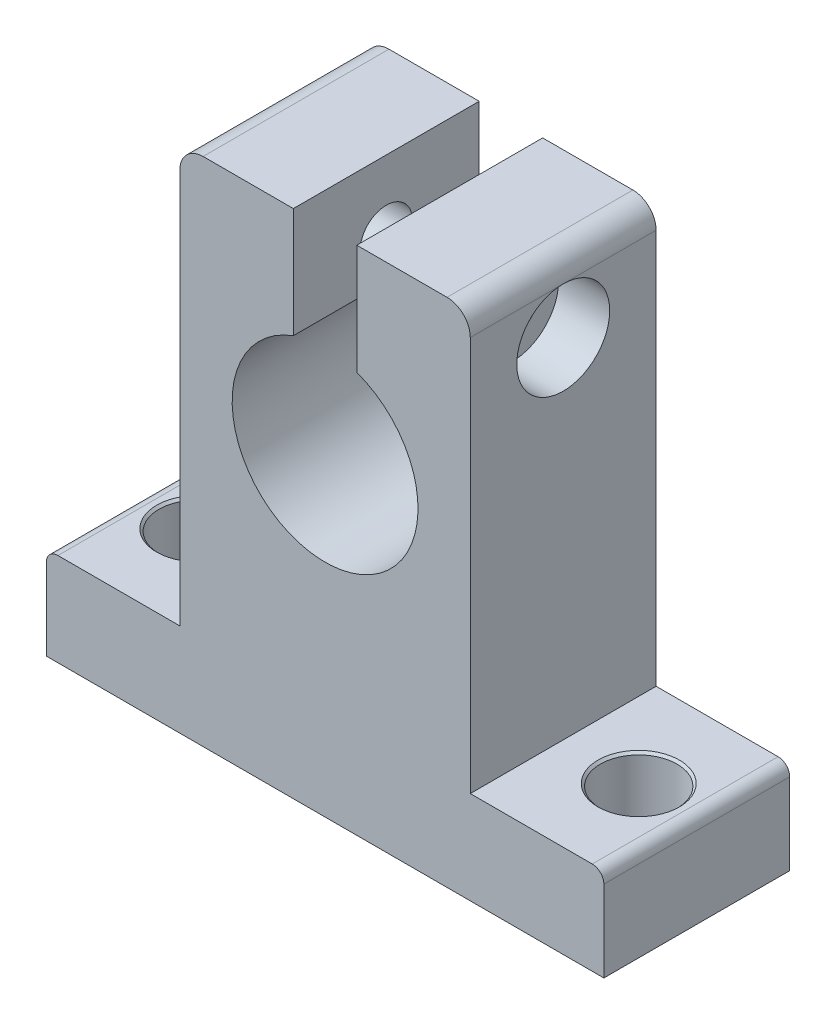
ISO-10303-21;
HEADER;
FILE_DESCRIPTION(('STEP AP214'),'2;1');
FILE_NAME('part.step','',(''),(''),'','','');
FILE_SCHEMA(('AUTOMOTIVE_DESIGN { 1 0 10303 214 1 1 1 1 }'));
ENDSEC;
DATA;
#1=APPLICATION_CONTEXT('core data for automotive mechanical design processes');
#2=APPLICATION_PROTOCOL_DEFINITION('international standard','automotive_design',2000,#1);
#3=PRODUCT_CONTEXT('',#1,'mechanical');
#4=PRODUCT('Part','Part','',(#3));
#5=PRODUCT_RELATED_PRODUCT_CATEGORY('part','',(#4));
#6=PRODUCT_DEFINITION_FORMATION('','',#4);
#7=PRODUCT_DEFINITION_CONTEXT('part definition',#1,'design');
#8=PRODUCT_DEFINITION('design','',#6,#7);
#9=PRODUCT_DEFINITION_SHAPE('','',#8);
#10=(LENGTH_UNIT() NAMED_UNIT(*) SI_UNIT(.MILLI.,.METRE.));
#11=(NAMED_UNIT(*) PLANE_ANGLE_UNIT() SI_UNIT($,.RADIAN.));
#12=(NAMED_UNIT(*) SI_UNIT($,.STERADIAN.) SOLID_ANGLE_UNIT());
#13=UNCERTAINTY_MEASURE_WITH_UNIT(LENGTH_MEASURE(1.E-05),#10,'distance_accuracy_value','');
#14=(GEOMETRIC_REPRESENTATION_CONTEXT(3) GLOBAL_UNCERTAINTY_ASSIGNED_CONTEXT((#13)) GLOBAL_UNIT_ASSIGNED_CONTEXT((#10,
#11,#12)) REPRESENTATION_CONTEXT('',''));
#15=CARTESIAN_POINT('',(0.,0.,0.));
#16=DIRECTION('',(0.,0.,1.));
#17=DIRECTION('',(1.,0.,0.));
#18=AXIS2_PLACEMENT_3D('',#15,#16,#17);
#19=CARTESIAN_POINT('',(-24.,0.,16.));
#20=DIRECTION('',(1.,0.,0.));
#21=DIRECTION('',(0.,0.,-1.));
#22=AXIS2_PLACEMENT_3D('',#19,#20,#21);
#23=PLANE('',#22);
#24=DIRECTION('',(0.,-1.,0.));
#25=VECTOR('',#24,1.);
#26=CARTESIAN_POINT('',(-24.,0.,0.));
#27=LINE('',#26,#25);
#28=CARTESIAN_POINT('',(-24.,7.,0.));
#29=VERTEX_POINT('',#28);
#30=CARTESIAN_POINT('',(-24.,0.,0.));
#31=VERTEX_POINT('',#30);
#32=EDGE_CURVE('E186',#29,#31,#27,.T.);
#33=ORIENTED_EDGE('',*,*,#32,.T.);
#34=DIRECTION('',(0.,0.,-1.));
#35=VECTOR('',#34,1.);
#36=CARTESIAN_POINT('',(-24.,0.,16.));
#37=LINE('',#36,#35);
#38=CARTESIAN_POINT('',(-24.,0.,16.));
#39=VERTEX_POINT('',#38);
#40=EDGE_CURVE('E11',#39,#31,#37,.T.);
#41=ORIENTED_EDGE('',*,*,#40,.F.);
#42=DIRECTION('',(0.,-1.,0.));
#43=VECTOR('',#42,1.);
#44=CARTESIAN_POINT('',(-24.,0.,16.));
#45=LINE('',#44,#43);
#46=CARTESIAN_POINT('',(-24.,7.,16.));
#47=VERTEX_POINT('',#46);
#48=EDGE_CURVE('E219',#47,#39,#45,.T.);
#49=ORIENTED_EDGE('',*,*,#48,.F.);
#50=DIRECTION('',(0.,0.,-1.));
#51=VECTOR('',#50,1.);
#52=CARTESIAN_POINT('',(-24.,7.,16.));
#53=LINE('',#52,#51);
#54=EDGE_CURVE('E182',#47,#29,#53,.T.);
#55=ORIENTED_EDGE('',*,*,#54,.T.);
#56=EDGE_LOOP('',(#33,#41,#49,#55));
#57=FACE_BOUND('',#56,.T.);
#58=ADVANCED_FACE('F36',(#57),#23,.F.);
#59=CARTESIAN_POINT('',(24.,0.,16.));
#60=DIRECTION('',(0.,1.,0.));
#61=DIRECTION('',(0.,0.,1.));
#62=AXIS2_PLACEMENT_3D('',#59,#60,#61);
#63=PLANE('',#62);
#64=CARTESIAN_POINT('',(-19.,0.,8.));
#65=DIRECTION('',(0.,1.,0.));
#66=DIRECTION('',(0.,0.,1.));
#67=AXIS2_PLACEMENT_3D('',#64,#65,#66);
#68=CIRCLE('',#67,3.3);
#69=CARTESIAN_POINT('',(-19.,0.,11.3));
#70=VERTEX_POINT('',#69);
#71=EDGE_CURVE('E320',#70,#70,#68,.T.);
#72=ORIENTED_EDGE('',*,*,#71,.T.);
#73=EDGE_LOOP('',(#72));
#74=FACE_BOUND('',#73,.T.);
#75=CARTESIAN_POINT('',(19.,0.,8.));
#76=DIRECTION('',(0.,1.,0.));
#77=DIRECTION('',(0.,0.,1.));
#78=AXIS2_PLACEMENT_3D('',#75,#76,#77);
#79=CIRCLE('',#78,3.3);
#80=CARTESIAN_POINT('',(19.,0.,11.3));
#81=VERTEX_POINT('',#80);
#82=EDGE_CURVE('E190',#81,#81,#79,.T.);
#83=ORIENTED_EDGE('',*,*,#82,.T.);
#84=EDGE_LOOP('',(#83));
#85=FACE_BOUND('',#84,.T.);
#86=DIRECTION('',(1.,0.,0.));
#87=VECTOR('',#86,1.);
#88=CARTESIAN_POINT('',(24.,0.,0.));
#89=LINE('',#88,#87);
#90=CARTESIAN_POINT('',(24.,0.,0.));
#91=VERTEX_POINT('',#90);
#92=EDGE_CURVE('E189',#31,#91,#89,.T.);
#93=ORIENTED_EDGE('',*,*,#92,.T.);
#94=DIRECTION('',(0.,0.,-1.));
#95=VECTOR('',#94,1.);
#96=CARTESIAN_POINT('',(24.,0.,16.));
#97=LINE('',#96,#95);
#98=CARTESIAN_POINT('',(24.,0.,16.));
#99=VERTEX_POINT('',#98);
#100=EDGE_CURVE('E44',#99,#91,#97,.T.);
#101=ORIENTED_EDGE('',*,*,#100,.F.);
#102=DIRECTION('',(1.,0.,0.));
#103=VECTOR('',#102,1.);
#104=CARTESIAN_POINT('',(24.,0.,16.));
#105=LINE('',#104,#103);
#106=EDGE_CURVE('E121',#39,#99,#105,.T.);
#107=ORIENTED_EDGE('',*,*,#106,.F.);
#108=ORIENTED_EDGE('',*,*,#40,.T.);
#109=EDGE_LOOP('',(#93,#101,#107,#108));
#110=FACE_BOUND('',#109,.T.);
#111=ADVANCED_FACE('F355',(#74,#85,#110),#63,.F.);
#112=CARTESIAN_POINT('',(24.,0.,16.));
#113=DIRECTION('',(-1.,0.,0.));
#114=DIRECTION('',(0.,0.,1.));
#115=AXIS2_PLACEMENT_3D('',#112,#113,#114);
#116=PLANE('',#115);
#117=DIRECTION('',(0.,1.,0.));
#118=VECTOR('',#117,1.);
#119=CARTESIAN_POINT('',(24.,0.,0.));
#120=LINE('',#119,#118);
#121=CARTESIAN_POINT('',(24.,7.,0.));
#122=VERTEX_POINT('',#121);
#123=EDGE_CURVE('E192',#91,#122,#120,.T.);
#124=ORIENTED_EDGE('',*,*,#123,.T.);
#125=DIRECTION('',(0.,0.,-1.));
#126=VECTOR('',#125,1.);
#127=CARTESIAN_POINT('',(24.,7.,16.));
#128=LINE('',#127,#126);
#129=CARTESIAN_POINT('',(24.,7.,16.));
#130=VERTEX_POINT('',#129);
#131=EDGE_CURVE('E251',#130,#122,#128,.T.);
#132=ORIENTED_EDGE('',*,*,#131,.F.);
#133=DIRECTION('',(0.,1.,0.));
#134=VECTOR('',#133,1.);
#135=CARTESIAN_POINT('',(24.,0.,16.));
#136=LINE('',#135,#134);
#137=EDGE_CURVE('E260',#99,#130,#136,.T.);
#138=ORIENTED_EDGE('',*,*,#137,.F.);
#139=ORIENTED_EDGE('',*,*,#100,.T.);
#140=EDGE_LOOP('',(#124,#132,#138,#139));
#141=FACE_BOUND('',#140,.T.);
#142=ADVANCED_FACE('F258',(#141),#116,.F.);
#143=CARTESIAN_POINT('',(23.,7.,16.));
#144=DIRECTION('',(0.,0.,-1.));
#145=DIRECTION('',(-1.,0.,0.));
#146=AXIS2_PLACEMENT_3D('',#143,#144,#145);
#147=CYLINDRICAL_SURFACE('',#146,1.);
#148=CARTESIAN_POINT('',(23.,7.,0.));
#149=DIRECTION('',(0.,0.,1.));
#150=DIRECTION('',(1.,0.,0.));
#151=AXIS2_PLACEMENT_3D('',#148,#149,#150);
#152=CIRCLE('',#151,1.);
#153=CARTESIAN_POINT('',(23.,8.,0.));
#154=VERTEX_POINT('',#153);
#155=EDGE_CURVE('E194',#122,#154,#152,.T.);
#156=ORIENTED_EDGE('',*,*,#155,.T.);
#157=DIRECTION('',(0.,0.,-1.));
#158=VECTOR('',#157,1.);
#159=CARTESIAN_POINT('',(23.,8.,16.));
#160=LINE('',#159,#158);
#161=CARTESIAN_POINT('',(23.,8.,16.));
#162=VERTEX_POINT('',#161);
#163=EDGE_CURVE('E248',#162,#154,#160,.T.);
#164=ORIENTED_EDGE('',*,*,#163,.F.);
#165=CARTESIAN_POINT('',(23.,7.,16.));
#166=DIRECTION('',(0.,0.,1.));
#167=DIRECTION('',(1.,0.,0.));
#168=AXIS2_PLACEMENT_3D('',#165,#166,#167);
#169=CIRCLE('',#168,1.);
#170=EDGE_CURVE('E278',#130,#162,#169,.T.);
#171=ORIENTED_EDGE('',*,*,#170,.F.);
#172=ORIENTED_EDGE('',*,*,#131,.T.);
#173=EDGE_LOOP('',(#156,#164,#171,#172));
#174=FACE_BOUND('',#173,.T.);
#175=ADVANCED_FACE('F269',(#174),#147,.T.);
#176=CARTESIAN_POINT('',(23.,8.,16.));
#177=DIRECTION('',(0.,-1.,0.));
#178=DIRECTION('',(0.,0.,-1.));
#179=AXIS2_PLACEMENT_3D('',#176,#177,#178);
#180=PLANE('',#179);
#181=CARTESIAN_POINT('',(19.,8.,8.));
#182=DIRECTION('',(0.,1.,0.));
#183=DIRECTION('',(0.,0.,1.));
#184=AXIS2_PLACEMENT_3D('',#181,#182,#183);
#185=CIRCLE('',#184,3.5);
#186=CARTESIAN_POINT('',(19.,8.,11.5));
#187=VERTEX_POINT('',#186);
#188=EDGE_CURVE('E317',#187,#187,#185,.T.);
#189=ORIENTED_EDGE('',*,*,#188,.F.);
#190=EDGE_LOOP('',(#189));
#191=FACE_BOUND('',#190,.T.);
#192=DIRECTION('',(-1.,0.,0.));
#193=VECTOR('',#192,1.);
#194=CARTESIAN_POINT('',(23.,8.,0.));
#195=LINE('',#194,#193);
#196=CARTESIAN_POINT('',(12.5,8.,0.));
#197=VERTEX_POINT('',#196);
#198=EDGE_CURVE('E196',#154,#197,#195,.T.);
#199=ORIENTED_EDGE('',*,*,#198,.T.);
#200=DIRECTION('',(0.,0.,-1.));
#201=VECTOR('',#200,1.);
#202=CARTESIAN_POINT('',(12.5,8.,16.));
#203=LINE('',#202,#201);
#204=CARTESIAN_POINT('',(12.5,8.,16.));
#205=VERTEX_POINT('',#204);
#206=EDGE_CURVE('E245',#205,#197,#203,.T.);
#207=ORIENTED_EDGE('',*,*,#206,.F.);
#208=DIRECTION('',(-1.,0.,0.));
#209=VECTOR('',#208,1.);
#210=CARTESIAN_POINT('',(23.,8.,16.));
#211=LINE('',#210,#209);
#212=EDGE_CURVE('E275',#162,#205,#211,.T.);
#213=ORIENTED_EDGE('',*,*,#212,.F.);
#214=ORIENTED_EDGE('',*,*,#163,.T.);
#215=EDGE_LOOP('',(#199,#207,#213,#214));
#216=FACE_BOUND('',#215,.T.);
#217=ADVANCED_FACE('F273',(#191,#216),#180,.F.);
#218=CARTESIAN_POINT('',(12.5,8.,16.));
#219=DIRECTION('',(-1.,0.,0.));
#220=DIRECTION('',(0.,0.,1.));
#221=AXIS2_PLACEMENT_3D('',#218,#219,#220);
#222=PLANE('',#221);
#223=DIRECTION('',(0.,0.,-1.));
#224=VECTOR('',#223,1.);
#225=CARTESIAN_POINT('',(12.5,42.,16.));
#226=LINE('',#225,#224);
#227=CARTESIAN_POINT('',(12.5,42.,8.));
#228=VERTEX_POINT('',#227);
#229=CARTESIAN_POINT('',(12.5,42.,0.));
#230=VERTEX_POINT('',#229);
#231=EDGE_CURVE('E241',#228,#230,#226,.T.);
#232=ORIENTED_EDGE('',*,*,#231,.F.);
#233=CARTESIAN_POINT('',(12.5,38.,8.));
#234=DIRECTION('',(1.,0.,0.));
#235=DIRECTION('',(0.,0.,-1.));
#236=AXIS2_PLACEMENT_3D('',#233,#234,#235);
#237=CIRCLE('',#236,4.);
#238=EDGE_CURVE('E49',#228,#228,#237,.T.);
#239=ORIENTED_EDGE('',*,*,#238,.F.);
#240=CARTESIAN_POINT('',(12.5,42.,16.));
#241=VERTEX_POINT('',#240);
#242=EDGE_CURVE('E242',#241,#228,#226,.T.);
#243=ORIENTED_EDGE('',*,*,#242,.F.);
#244=DIRECTION('',(0.,1.,0.));
#245=VECTOR('',#244,1.);
#246=CARTESIAN_POINT('',(12.5,8.,16.));
#247=LINE('',#246,#245);
#248=EDGE_CURVE('E277',#205,#241,#247,.T.);
#249=ORIENTED_EDGE('',*,*,#248,.F.);
#250=ORIENTED_EDGE('',*,*,#206,.T.);
#251=DIRECTION('',(0.,1.,0.));
#252=VECTOR('',#251,1.);
#253=CARTESIAN_POINT('',(12.5,8.,0.));
#254=LINE('',#253,#252);
#255=EDGE_CURVE('E198',#197,#230,#254,.T.);
#256=ORIENTED_EDGE('',*,*,#255,.T.);
#257=EDGE_LOOP('',(#232,#239,#243,#249,#250,#256));
#258=FACE_BOUND('',#257,.T.);
#259=ADVANCED_FACE('F370',(#258),#222,.F.);
#260=CARTESIAN_POINT('',(10.5,42.,16.));
#261=DIRECTION('',(0.,0.,-1.));
#262=DIRECTION('',(-1.,0.,0.));
#263=AXIS2_PLACEMENT_3D('',#260,#261,#262);
#264=CYLINDRICAL_SURFACE('',#263,2.);
#265=CARTESIAN_POINT('',(10.5,42.,0.));
#266=DIRECTION('',(0.,0.,1.));
#267=DIRECTION('',(1.,0.,0.));
#268=AXIS2_PLACEMENT_3D('',#265,#266,#267);
#269=CIRCLE('',#268,2.);
#270=CARTESIAN_POINT('',(10.5,44.,0.));
#271=VERTEX_POINT('',#270);
#272=EDGE_CURVE('E201',#230,#271,#269,.T.);
#273=ORIENTED_EDGE('',*,*,#272,.T.);
#274=DIRECTION('',(0.,0.,-1.));
#275=VECTOR('',#274,1.);
#276=CARTESIAN_POINT('',(10.5,44.,16.));
#277=LINE('',#276,#275);
#278=CARTESIAN_POINT('',(10.5,44.,16.));
#279=VERTEX_POINT('',#278);
#280=EDGE_CURVE('E238',#279,#271,#277,.T.);
#281=ORIENTED_EDGE('',*,*,#280,.F.);
#282=CARTESIAN_POINT('',(10.5,42.,16.));
#283=DIRECTION('',(0.,0.,1.));
#284=DIRECTION('',(1.,0.,0.));
#285=AXIS2_PLACEMENT_3D('',#282,#283,#284);
#286=CIRCLE('',#285,2.);
#287=EDGE_CURVE('E280',#241,#279,#286,.T.);
#288=ORIENTED_EDGE('',*,*,#287,.F.);
#289=ORIENTED_EDGE('',*,*,#242,.T.);
#290=ORIENTED_EDGE('',*,*,#231,.T.);
#291=EDGE_LOOP('',(#273,#281,#288,#289,#290));
#292=FACE_BOUND('',#291,.T.);
#293=ADVANCED_FACE('F374',(#292),#264,.T.);
#294=CARTESIAN_POINT('',(10.5,44.,16.));
#295=DIRECTION('',(0.,-1.,0.));
#296=DIRECTION('',(0.,0.,-1.));
#297=AXIS2_PLACEMENT_3D('',#294,#295,#296);
#298=PLANE('',#297);
#299=DIRECTION('',(-1.,0.,0.));
#300=VECTOR('',#299,1.);
#301=CARTESIAN_POINT('',(10.5,44.,0.));
#302=LINE('',#301,#300);
#303=CARTESIAN_POINT('',(2.7316831368652,44.,0.));
#304=VERTEX_POINT('',#303);
#305=EDGE_CURVE('E203',#271,#304,#302,.T.);
#306=ORIENTED_EDGE('',*,*,#305,.T.);
#307=DIRECTION('',(0.,0.,-1.));
#308=VECTOR('',#307,1.);
#309=CARTESIAN_POINT('',(2.7316831368652,44.,16.));
#310=LINE('',#309,#308);
#311=CARTESIAN_POINT('',(2.7316831368652,44.,16.));
#312=VERTEX_POINT('',#311);
#313=EDGE_CURVE('E235',#312,#304,#310,.T.);
#314=ORIENTED_EDGE('',*,*,#313,.F.);
#315=DIRECTION('',(-1.,0.,0.));
#316=VECTOR('',#315,1.);
#317=CARTESIAN_POINT('',(10.5,44.,16.));
#318=LINE('',#317,#316);
#319=EDGE_CURVE('E286',#279,#312,#318,.T.);
#320=ORIENTED_EDGE('',*,*,#319,.F.);
#321=ORIENTED_EDGE('',*,*,#280,.T.);
#322=EDGE_LOOP('',(#306,#314,#320,#321));
#323=FACE_BOUND('',#322,.T.);
#324=ADVANCED_FACE('F378',(#323),#298,.F.);
#325=CARTESIAN_POINT('',(2.7316831368652,44.,16.));
#326=DIRECTION('',(1.,0.,0.));
#327=DIRECTION('',(0.,1.,0.));
#328=AXIS2_PLACEMENT_3D('',#325,#326,#327);
#329=PLANE('',#328);
#330=CARTESIAN_POINT('',(2.7316831368652,38.,8.));
#331=DIRECTION('',(1.,0.,0.));
#332=DIRECTION('',(0.,1.,0.));
#333=AXIS2_PLACEMENT_3D('',#330,#331,#332);
#334=CIRCLE('',#333,2.25);
#335=CARTESIAN_POINT('',(2.7316831368652,40.25,8.));
#336=VERTEX_POINT('',#335);
#337=EDGE_CURVE('E329',#336,#336,#334,.T.);
#338=ORIENTED_EDGE('',*,*,#337,.T.);
#339=EDGE_LOOP('',(#338));
#340=FACE_BOUND('',#339,.T.);
#341=DIRECTION('',(0.,-1.,0.));
#342=VECTOR('',#341,1.);
#343=CARTESIAN_POINT('',(2.7316831368652,44.,0.));
#344=LINE('',#343,#342);
#345=CARTESIAN_POINT('',(2.7316831368652,34.5191693184664,0.));
#346=VERTEX_POINT('',#345);
#347=EDGE_CURVE('E205',#304,#346,#344,.T.);
#348=ORIENTED_EDGE('',*,*,#347,.T.);
#349=DIRECTION('',(0.,0.,-1.));
#350=VECTOR('',#349,1.);
#351=CARTESIAN_POINT('',(2.7316831368652,34.5191693184664,16.));
#352=LINE('',#351,#350);
#353=CARTESIAN_POINT('',(2.7316831368652,34.5191693184664,16.));
#354=VERTEX_POINT('',#353);
#355=EDGE_CURVE('E232',#354,#346,#352,.T.);
#356=ORIENTED_EDGE('',*,*,#355,.F.);
#357=DIRECTION('',(0.,-1.,0.));
#358=VECTOR('',#357,1.);
#359=CARTESIAN_POINT('',(2.7316831368652,44.,16.));
#360=LINE('',#359,#358);
#361=EDGE_CURVE('E288',#312,#354,#360,.T.);
#362=ORIENTED_EDGE('',*,*,#361,.F.);
#363=ORIENTED_EDGE('',*,*,#313,.T.);
#364=EDGE_LOOP('',(#348,#356,#362,#363));
#365=FACE_BOUND('',#364,.T.);
#366=ADVANCED_FACE('F382',(#340,#365),#329,.F.);
#367=CARTESIAN_POINT('',(0.,27.,16.));
#368=DIRECTION('',(0.,0.,-1.));
#369=DIRECTION('',(-1.,0.,0.));
#370=AXIS2_PLACEMENT_3D('',#367,#368,#369);
#371=CYLINDRICAL_SURFACE('',#370,8.);
#372=CARTESIAN_POINT('',(0.,27.,0.));
#373=DIRECTION('',(0.,0.,-1.));
#374=DIRECTION('',(1.,0.,0.));
#375=AXIS2_PLACEMENT_3D('',#372,#373,#374);
#376=CIRCLE('',#375,8.);
#377=CARTESIAN_POINT('',(-2.7316831368652,34.5191693184664,0.));
#378=VERTEX_POINT('',#377);
#379=EDGE_CURVE('E207',#346,#378,#376,.T.);
#380=ORIENTED_EDGE('',*,*,#379,.T.);
#381=DIRECTION('',(0.,0.,-1.));
#382=VECTOR('',#381,1.);
#383=CARTESIAN_POINT('',(-2.7316831368652,34.5191693184664,16.));
#384=LINE('',#383,#382);
#385=CARTESIAN_POINT('',(-2.7316831368652,34.5191693184664,16.));
#386=VERTEX_POINT('',#385);
#387=EDGE_CURVE('E229',#386,#378,#384,.T.);
#388=ORIENTED_EDGE('',*,*,#387,.F.);
#389=CARTESIAN_POINT('',(0.,27.,16.));
#390=DIRECTION('',(0.,0.,-1.));
#391=DIRECTION('',(1.,0.,0.));
#392=AXIS2_PLACEMENT_3D('',#389,#390,#391);
#393=CIRCLE('',#392,8.);
#394=EDGE_CURVE('E290',#354,#386,#393,.T.);
#395=ORIENTED_EDGE('',*,*,#394,.F.);
#396=ORIENTED_EDGE('',*,*,#355,.T.);
#397=EDGE_LOOP('',(#380,#388,#395,#396));
#398=FACE_BOUND('',#397,.T.);
#399=ADVANCED_FACE('F386',(#398),#371,.F.);
#400=CARTESIAN_POINT('',(-2.7316831368652,44.,16.));
#401=DIRECTION('',(-1.,0.,0.));
#402=DIRECTION('',(0.,-1.,0.));
#403=AXIS2_PLACEMENT_3D('',#400,#401,#402);
#404=PLANE('',#403);
#405=CARTESIAN_POINT('',(-2.7316831368652,38.,8.));
#406=DIRECTION('',(-1.,0.,0.));
#407=DIRECTION('',(0.,-1.,0.));
#408=AXIS2_PLACEMENT_3D('',#405,#406,#407);
#409=CIRCLE('',#408,2.25);
#410=CARTESIAN_POINT('',(-2.7316831368652,35.75,8.));
#411=VERTEX_POINT('',#410);
#412=EDGE_CURVE('E332',#411,#411,#409,.T.);
#413=ORIENTED_EDGE('',*,*,#412,.T.);
#414=EDGE_LOOP('',(#413));
#415=FACE_BOUND('',#414,.T.);
#416=DIRECTION('',(0.,1.,0.));
#417=VECTOR('',#416,1.);
#418=CARTESIAN_POINT('',(-2.7316831368652,44.,0.));
#419=LINE('',#418,#417);
#420=CARTESIAN_POINT('',(-2.7316831368652,44.,0.));
#421=VERTEX_POINT('',#420);
#422=EDGE_CURVE('E209',#378,#421,#419,.T.);
#423=ORIENTED_EDGE('',*,*,#422,.T.);
#424=DIRECTION('',(0.,0.,-1.));
#425=VECTOR('',#424,1.);
#426=CARTESIAN_POINT('',(-2.7316831368652,44.,16.));
#427=LINE('',#426,#425);
#428=CARTESIAN_POINT('',(-2.7316831368652,44.,16.));
#429=VERTEX_POINT('',#428);
#430=EDGE_CURVE('E226',#429,#421,#427,.T.);
#431=ORIENTED_EDGE('',*,*,#430,.F.);
#432=DIRECTION('',(0.,1.,0.));
#433=VECTOR('',#432,1.);
#434=CARTESIAN_POINT('',(-2.7316831368652,44.,16.));
#435=LINE('',#434,#433);
#436=EDGE_CURVE('E292',#386,#429,#435,.T.);
#437=ORIENTED_EDGE('',*,*,#436,.F.);
#438=ORIENTED_EDGE('',*,*,#387,.T.);
#439=EDGE_LOOP('',(#423,#431,#437,#438));
#440=FACE_BOUND('',#439,.T.);
#441=ADVANCED_FACE('F390',(#415,#440),#404,.F.);
#442=CARTESIAN_POINT('',(-10.5,44.,16.));
#443=DIRECTION('',(0.,-1.,0.));
#444=DIRECTION('',(0.,0.,-1.));
#445=AXIS2_PLACEMENT_3D('',#442,#443,#444);
#446=PLANE('',#445);
#447=DIRECTION('',(-1.,0.,0.));
#448=VECTOR('',#447,1.);
#449=CARTESIAN_POINT('',(-10.5,44.,0.));
#450=LINE('',#449,#448);
#451=CARTESIAN_POINT('',(-10.5,44.,0.));
#452=VERTEX_POINT('',#451);
#453=EDGE_CURVE('E211',#421,#452,#450,.T.);
#454=ORIENTED_EDGE('',*,*,#453,.T.);
#455=DIRECTION('',(0.,0.,-1.));
#456=VECTOR('',#455,1.);
#457=CARTESIAN_POINT('',(-10.5,44.,16.));
#458=LINE('',#457,#456);
#459=CARTESIAN_POINT('',(-10.5,44.,16.));
#460=VERTEX_POINT('',#459);
#461=EDGE_CURVE('E223',#460,#452,#458,.T.);
#462=ORIENTED_EDGE('',*,*,#461,.F.);
#463=DIRECTION('',(-1.,0.,0.));
#464=VECTOR('',#463,1.);
#465=CARTESIAN_POINT('',(-10.5,44.,16.));
#466=LINE('',#465,#464);
#467=EDGE_CURVE('E294',#429,#460,#466,.T.);
#468=ORIENTED_EDGE('',*,*,#467,.F.);
#469=ORIENTED_EDGE('',*,*,#430,.T.);
#470=EDGE_LOOP('',(#454,#462,#468,#469));
#471=FACE_BOUND('',#470,.T.);
#472=ADVANCED_FACE('F300',(#471),#446,.F.);
#473=CARTESIAN_POINT('',(-10.5,42.,16.));
#474=DIRECTION('',(0.,0.,-1.));
#475=DIRECTION('',(-1.,0.,0.));
#476=AXIS2_PLACEMENT_3D('',#473,#474,#475);
#477=CYLINDRICAL_SURFACE('',#476,2.);
#478=CARTESIAN_POINT('',(-10.5,42.,0.));
#479=DIRECTION('',(0.,0.,1.));
#480=DIRECTION('',(-1.,0.,0.));
#481=AXIS2_PLACEMENT_3D('',#478,#479,#480);
#482=CIRCLE('',#481,2.);
#483=CARTESIAN_POINT('',(-12.5,42.,0.));
#484=VERTEX_POINT('',#483);
#485=EDGE_CURVE('E213',#452,#484,#482,.T.);
#486=ORIENTED_EDGE('',*,*,#485,.T.);
#487=DIRECTION('',(0.,0.,-1.));
#488=VECTOR('',#487,1.);
#489=CARTESIAN_POINT('',(-12.5,42.,16.));
#490=LINE('',#489,#488);
#491=CARTESIAN_POINT('',(-12.5,42.,16.));
#492=VERTEX_POINT('',#491);
#493=EDGE_CURVE('E177',#492,#484,#490,.T.);
#494=ORIENTED_EDGE('',*,*,#493,.F.);
#495=CARTESIAN_POINT('',(-10.5,42.,16.));
#496=DIRECTION('',(0.,0.,1.));
#497=DIRECTION('',(-1.,0.,0.));
#498=AXIS2_PLACEMENT_3D('',#495,#496,#497);
#499=CIRCLE('',#498,2.);
#500=EDGE_CURVE('E165',#460,#492,#499,.T.);
#501=ORIENTED_EDGE('',*,*,#500,.F.);
#502=ORIENTED_EDGE('',*,*,#461,.T.);
#503=EDGE_LOOP('',(#486,#494,#501,#502));
#504=FACE_BOUND('',#503,.T.);
#505=ADVANCED_FACE('F304',(#504),#477,.T.);
#506=CARTESIAN_POINT('',(-12.5,8.,16.));
#507=DIRECTION('',(1.,0.,0.));
#508=DIRECTION('',(0.,0.,-1.));
#509=AXIS2_PLACEMENT_3D('',#506,#507,#508);
#510=PLANE('',#509);
#511=CARTESIAN_POINT('',(-12.5,38.,8.));
#512=DIRECTION('',(1.,0.,0.));
#513=DIRECTION('',(0.,0.,-1.));
#514=AXIS2_PLACEMENT_3D('',#511,#512,#513);
#515=CIRCLE('',#514,2.25);
#516=CARTESIAN_POINT('',(-12.5,38.,5.75));
#517=VERTEX_POINT('',#516);
#518=EDGE_CURVE('E39',#517,#517,#515,.T.);
#519=ORIENTED_EDGE('',*,*,#518,.T.);
#520=EDGE_LOOP('',(#519));
#521=FACE_BOUND('',#520,.T.);
#522=DIRECTION('',(0.,-1.,0.));
#523=VECTOR('',#522,1.);
#524=CARTESIAN_POINT('',(-12.5,8.,0.));
#525=LINE('',#524,#523);
#526=CARTESIAN_POINT('',(-12.5,8.,0.));
#527=VERTEX_POINT('',#526);
#528=EDGE_CURVE('E174',#484,#527,#525,.T.);
#529=ORIENTED_EDGE('',*,*,#528,.T.);
#530=DIRECTION('',(0.,0.,-1.));
#531=VECTOR('',#530,1.);
#532=CARTESIAN_POINT('',(-12.5,8.,16.));
#533=LINE('',#532,#531);
#534=CARTESIAN_POINT('',(-12.5,8.,16.));
#535=VERTEX_POINT('',#534);
#536=EDGE_CURVE('E171',#535,#527,#533,.T.);
#537=ORIENTED_EDGE('',*,*,#536,.F.);
#538=DIRECTION('',(0.,-1.,0.));
#539=VECTOR('',#538,1.);
#540=CARTESIAN_POINT('',(-12.5,8.,16.));
#541=LINE('',#540,#539);
#542=EDGE_CURVE('E158',#492,#535,#541,.T.);
#543=ORIENTED_EDGE('',*,*,#542,.F.);
#544=ORIENTED_EDGE('',*,*,#493,.T.);
#545=EDGE_LOOP('',(#529,#537,#543,#544));
#546=FACE_BOUND('',#545,.T.);
#547=ADVANCED_FACE('F172',(#521,#546),#510,.F.);
#548=CARTESIAN_POINT('',(-23.,8.,16.));
#549=DIRECTION('',(0.,-1.,0.));
#550=DIRECTION('',(0.,0.,-1.));
#551=AXIS2_PLACEMENT_3D('',#548,#549,#550);
#552=PLANE('',#551);
#553=CARTESIAN_POINT('',(-19.,8.,8.));
#554=DIRECTION('',(0.,1.,0.));
#555=DIRECTION('',(0.,0.,1.));
#556=AXIS2_PLACEMENT_3D('',#553,#554,#555);
#557=CIRCLE('',#556,3.5);
#558=CARTESIAN_POINT('',(-19.,8.,11.5));
#559=VERTEX_POINT('',#558);
#560=EDGE_CURVE('E326',#559,#559,#557,.T.);
#561=ORIENTED_EDGE('',*,*,#560,.F.);
#562=EDGE_LOOP('',(#561));
#563=FACE_BOUND('',#562,.T.);
#564=DIRECTION('',(-1.,0.,0.));
#565=VECTOR('',#564,1.);
#566=CARTESIAN_POINT('',(-23.,8.,0.));
#567=LINE('',#566,#565);
#568=CARTESIAN_POINT('',(-23.,8.,0.));
#569=VERTEX_POINT('',#568);
#570=EDGE_CURVE('E216',#527,#569,#567,.T.);
#571=ORIENTED_EDGE('',*,*,#570,.T.);
#572=DIRECTION('',(0.,0.,-1.));
#573=VECTOR('',#572,1.);
#574=CARTESIAN_POINT('',(-23.,8.,16.));
#575=LINE('',#574,#573);
#576=CARTESIAN_POINT('',(-23.,8.,16.));
#577=VERTEX_POINT('',#576);
#578=EDGE_CURVE('E178',#577,#569,#575,.T.);
#579=ORIENTED_EDGE('',*,*,#578,.F.);
#580=DIRECTION('',(-1.,0.,0.));
#581=VECTOR('',#580,1.);
#582=CARTESIAN_POINT('',(-23.,8.,16.));
#583=LINE('',#582,#581);
#584=EDGE_CURVE('E162',#535,#577,#583,.T.);
#585=ORIENTED_EDGE('',*,*,#584,.F.);
#586=ORIENTED_EDGE('',*,*,#536,.T.);
#587=EDGE_LOOP('',(#571,#579,#585,#586));
#588=FACE_BOUND('',#587,.T.);
#589=ADVANCED_FACE('F180',(#563,#588),#552,.F.);
#590=CARTESIAN_POINT('',(-23.,7.,16.));
#591=DIRECTION('',(0.,0.,-1.));
#592=DIRECTION('',(-1.,0.,0.));
#593=AXIS2_PLACEMENT_3D('',#590,#591,#592);
#594=CYLINDRICAL_SURFACE('',#593,1.);
#595=CARTESIAN_POINT('',(-23.,7.,0.));
#596=DIRECTION('',(0.,0.,1.));
#597=DIRECTION('',(-1.,0.,0.));
#598=AXIS2_PLACEMENT_3D('',#595,#596,#597);
#599=CIRCLE('',#598,1.);
#600=EDGE_CURVE('E113',#569,#29,#599,.T.);
#601=ORIENTED_EDGE('',*,*,#600,.T.);
#602=ORIENTED_EDGE('',*,*,#54,.F.);
#603=CARTESIAN_POINT('',(-23.,7.,16.));
#604=DIRECTION('',(0.,0.,1.));
#605=DIRECTION('',(-1.,0.,0.));
#606=AXIS2_PLACEMENT_3D('',#603,#604,#605);
#607=CIRCLE('',#606,1.);
#608=EDGE_CURVE('E57',#577,#47,#607,.T.);
#609=ORIENTED_EDGE('',*,*,#608,.F.);
#610=ORIENTED_EDGE('',*,*,#578,.T.);
#611=EDGE_LOOP('',(#601,#602,#609,#610));
#612=FACE_BOUND('',#611,.T.);
#613=ADVANCED_FACE('F305',(#612),#594,.T.);
#614=CARTESIAN_POINT('',(-23.,7.,16.));
#615=DIRECTION('',(0.,0.,-1.));
#616=DIRECTION('',(-1.,0.,0.));
#617=AXIS2_PLACEMENT_3D('',#614,#615,#616);
#618=PLANE('',#617);
#619=ORIENTED_EDGE('',*,*,#48,.T.);
#620=ORIENTED_EDGE('',*,*,#106,.T.);
#621=ORIENTED_EDGE('',*,*,#137,.T.);
#622=ORIENTED_EDGE('',*,*,#170,.T.);
#623=ORIENTED_EDGE('',*,*,#212,.T.);
#624=ORIENTED_EDGE('',*,*,#248,.T.);
#625=ORIENTED_EDGE('',*,*,#287,.T.);
#626=ORIENTED_EDGE('',*,*,#319,.T.);
#627=ORIENTED_EDGE('',*,*,#361,.T.);
#628=ORIENTED_EDGE('',*,*,#394,.T.);
#629=ORIENTED_EDGE('',*,*,#436,.T.);
#630=ORIENTED_EDGE('',*,*,#467,.T.);
#631=ORIENTED_EDGE('',*,*,#500,.T.);
#632=ORIENTED_EDGE('',*,*,#542,.T.);
#633=ORIENTED_EDGE('',*,*,#584,.T.);
#634=ORIENTED_EDGE('',*,*,#608,.T.);
#635=EDGE_LOOP('',(#619,#620,#621,#622,#623,#624,#625,#626,#627,#628,#629,#630,#631,#632,#633,#634));
#636=FACE_BOUND('',#635,.T.);
#637=ADVANCED_FACE('F160',(#636),#618,.F.);
#638=CARTESIAN_POINT('',(-23.,7.,0.));
#639=DIRECTION('',(0.,0.,-1.));
#640=DIRECTION('',(-1.,0.,0.));
#641=AXIS2_PLACEMENT_3D('',#638,#639,#640);
#642=PLANE('',#641);
#643=ORIENTED_EDGE('',*,*,#32,.F.);
#644=ORIENTED_EDGE('',*,*,#600,.F.);
#645=ORIENTED_EDGE('',*,*,#570,.F.);
#646=ORIENTED_EDGE('',*,*,#528,.F.);
#647=ORIENTED_EDGE('',*,*,#485,.F.);
#648=ORIENTED_EDGE('',*,*,#453,.F.);
#649=ORIENTED_EDGE('',*,*,#422,.F.);
#650=ORIENTED_EDGE('',*,*,#379,.F.);
#651=ORIENTED_EDGE('',*,*,#347,.F.);
#652=ORIENTED_EDGE('',*,*,#305,.F.);
#653=ORIENTED_EDGE('',*,*,#272,.F.);
#654=ORIENTED_EDGE('',*,*,#255,.F.);
#655=ORIENTED_EDGE('',*,*,#198,.F.);
#656=ORIENTED_EDGE('',*,*,#155,.F.);
#657=ORIENTED_EDGE('',*,*,#123,.F.);
#658=ORIENTED_EDGE('',*,*,#92,.F.);
#659=EDGE_LOOP('',(#643,#644,#645,#646,#647,#648,#649,#650,#651,#652,#653,#654,#655,#656,#657,#658));
#660=FACE_BOUND('',#659,.T.);
#661=ADVANCED_FACE('F264',(#660),#642,.T.);
#662=CARTESIAN_POINT('',(19.,8.,8.));
#663=DIRECTION('',(0.,1.,0.));
#664=DIRECTION('',(0.,0.,1.));
#665=AXIS2_PLACEMENT_3D('',#662,#663,#664);
#666=CYLINDRICAL_SURFACE('',#665,3.3);
#667=ORIENTED_EDGE('',*,*,#82,.F.);
#668=EDGE_LOOP('',(#667));
#669=FACE_BOUND('',#668,.T.);
#670=CARTESIAN_POINT('',(19.,7.8,8.));
#671=DIRECTION('',(0.,1.,0.));
#672=DIRECTION('',(0.,0.,1.));
#673=AXIS2_PLACEMENT_3D('',#670,#671,#672);
#674=CIRCLE('',#673,3.3);
#675=CARTESIAN_POINT('',(19.,7.8,11.3));
#676=VERTEX_POINT('',#675);
#677=EDGE_CURVE('E314',#676,#676,#674,.T.);
#678=ORIENTED_EDGE('',*,*,#677,.T.);
#679=EDGE_LOOP('',(#678));
#680=FACE_BOUND('',#679,.T.);
#681=ADVANCED_FACE('F409',(#669,#680),#666,.F.);
#682=CARTESIAN_POINT('',(19.,8.,8.));
#683=DIRECTION('',(0.,1.,0.));
#684=DIRECTION('',(0.,0.,1.));
#685=AXIS2_PLACEMENT_3D('',#682,#683,#684);
#686=CONICAL_SURFACE('',#685,3.5,0.785398163397446);
#687=ORIENTED_EDGE('',*,*,#677,.F.);
#688=EDGE_LOOP('',(#687));
#689=FACE_BOUND('',#688,.T.);
#690=ORIENTED_EDGE('',*,*,#188,.T.);
#691=EDGE_LOOP('',(#690));
#692=FACE_BOUND('',#691,.T.);
#693=ADVANCED_FACE('F414',(#689,#692),#686,.F.);
#694=CARTESIAN_POINT('',(-19.,8.,8.));
#695=DIRECTION('',(0.,1.,0.));
#696=DIRECTION('',(0.,0.,1.));
#697=AXIS2_PLACEMENT_3D('',#694,#695,#696);
#698=CYLINDRICAL_SURFACE('',#697,3.3);
#699=ORIENTED_EDGE('',*,*,#71,.F.);
#700=EDGE_LOOP('',(#699));
#701=FACE_BOUND('',#700,.T.);
#702=CARTESIAN_POINT('',(-19.,7.8,8.));
#703=DIRECTION('',(0.,1.,0.));
#704=DIRECTION('',(0.,0.,1.));
#705=AXIS2_PLACEMENT_3D('',#702,#703,#704);
#706=CIRCLE('',#705,3.3);
#707=CARTESIAN_POINT('',(-19.,7.8,11.3));
#708=VERTEX_POINT('',#707);
#709=EDGE_CURVE('E323',#708,#708,#706,.T.);
#710=ORIENTED_EDGE('',*,*,#709,.T.);
#711=EDGE_LOOP('',(#710));
#712=FACE_BOUND('',#711,.T.);
#713=ADVANCED_FACE('F418',(#701,#712),#698,.F.);
#714=CARTESIAN_POINT('',(-19.,8.,8.));
#715=DIRECTION('',(0.,1.,0.));
#716=DIRECTION('',(0.,0.,1.));
#717=AXIS2_PLACEMENT_3D('',#714,#715,#716);
#718=CONICAL_SURFACE('',#717,3.5,0.785398163397446);
#719=ORIENTED_EDGE('',*,*,#709,.F.);
#720=EDGE_LOOP('',(#719));
#721=FACE_BOUND('',#720,.T.);
#722=ORIENTED_EDGE('',*,*,#560,.T.);
#723=EDGE_LOOP('',(#722));
#724=FACE_BOUND('',#723,.T.);
#725=ADVANCED_FACE('F422',(#721,#724),#718,.F.);
#726=CARTESIAN_POINT('',(12.5,38.,8.));
#727=DIRECTION('',(1.,0.,0.));
#728=DIRECTION('',(0.,0.,-1.));
#729=AXIS2_PLACEMENT_3D('',#726,#727,#728);
#730=CYLINDRICAL_SURFACE('',#729,2.25);
#731=ORIENTED_EDGE('',*,*,#518,.F.);
#732=EDGE_LOOP('',(#731));
#733=FACE_BOUND('',#732,.T.);
#734=ORIENTED_EDGE('',*,*,#412,.F.);
#735=EDGE_LOOP('',(#734));
#736=FACE_BOUND('',#735,.T.);
#737=ADVANCED_FACE('F426',(#733,#736),#730,.F.);
#738=CARTESIAN_POINT('',(8.1,38.,8.));
#739=DIRECTION('',(1.,0.,0.));
#740=DIRECTION('',(0.,0.,-1.));
#741=AXIS2_PLACEMENT_3D('',#738,#739,#740);
#742=CIRCLE('',#741,2.25);
#743=CARTESIAN_POINT('',(8.1,38.,5.75));
#744=VERTEX_POINT('',#743);
#745=EDGE_CURVE('E335',#744,#744,#742,.T.);
#746=ORIENTED_EDGE('',*,*,#745,.T.);
#747=EDGE_LOOP('',(#746));
#748=FACE_BOUND('',#747,.T.);
#749=ORIENTED_EDGE('',*,*,#337,.F.);
#750=EDGE_LOOP('',(#749));
#751=FACE_BOUND('',#750,.T.);
#752=ADVANCED_FACE('F351',(#748,#751),#730,.F.);
#753=CARTESIAN_POINT('',(8.1,40.25,8.));
#754=DIRECTION('',(-1.,0.,0.));
#755=DIRECTION('',(0.,0.,1.));
#756=AXIS2_PLACEMENT_3D('',#753,#754,#755);
#757=PLANE('',#756);
#758=ORIENTED_EDGE('',*,*,#745,.F.);
#759=EDGE_LOOP('',(#758));
#760=FACE_BOUND('',#759,.T.);
#761=CARTESIAN_POINT('',(8.1,38.,8.));
#762=DIRECTION('',(1.,0.,0.));
#763=DIRECTION('',(0.,0.,-1.));
#764=AXIS2_PLACEMENT_3D('',#761,#762,#763);
#765=CIRCLE('',#764,4.);
#766=CARTESIAN_POINT('',(8.1,38.,4.));
#767=VERTEX_POINT('',#766);
#768=EDGE_CURVE('E338',#767,#767,#765,.T.);
#769=ORIENTED_EDGE('',*,*,#768,.T.);
#770=EDGE_LOOP('',(#769));
#771=FACE_BOUND('',#770,.T.);
#772=ADVANCED_FACE('F343',(#760,#771),#757,.F.);
#773=CARTESIAN_POINT('',(12.5,38.,8.));
#774=DIRECTION('',(1.,0.,0.));
#775=DIRECTION('',(0.,0.,-1.));
#776=AXIS2_PLACEMENT_3D('',#773,#774,#775);
#777=CYLINDRICAL_SURFACE('',#776,4.);
#778=ORIENTED_EDGE('',*,*,#768,.F.);
#779=EDGE_LOOP('',(#778));
#780=FACE_BOUND('',#779,.T.);
#781=ORIENTED_EDGE('',*,*,#238,.T.);
#782=EDGE_LOOP('',(#781));
#783=FACE_BOUND('',#782,.T.);
#784=ADVANCED_FACE('F345',(#780,#783),#777,.F.);
#785=CLOSED_SHELL('',(#58,#111,#142,#175,#217,#259,#293,#324,#366,#399,#441,#472,#505,#547,#589,
#613,#637,#661,#681,#693,#713,#725,#737,#752,#772,#784));
#786=MANIFOLD_SOLID_BREP('B2',#785);
#787=ADVANCED_BREP_SHAPE_REPRESENTATION('',(#18,#786),#14);
#788=SHAPE_DEFINITION_REPRESENTATION(#9,#787);
ENDSEC;
END-ISO-10303-21;
